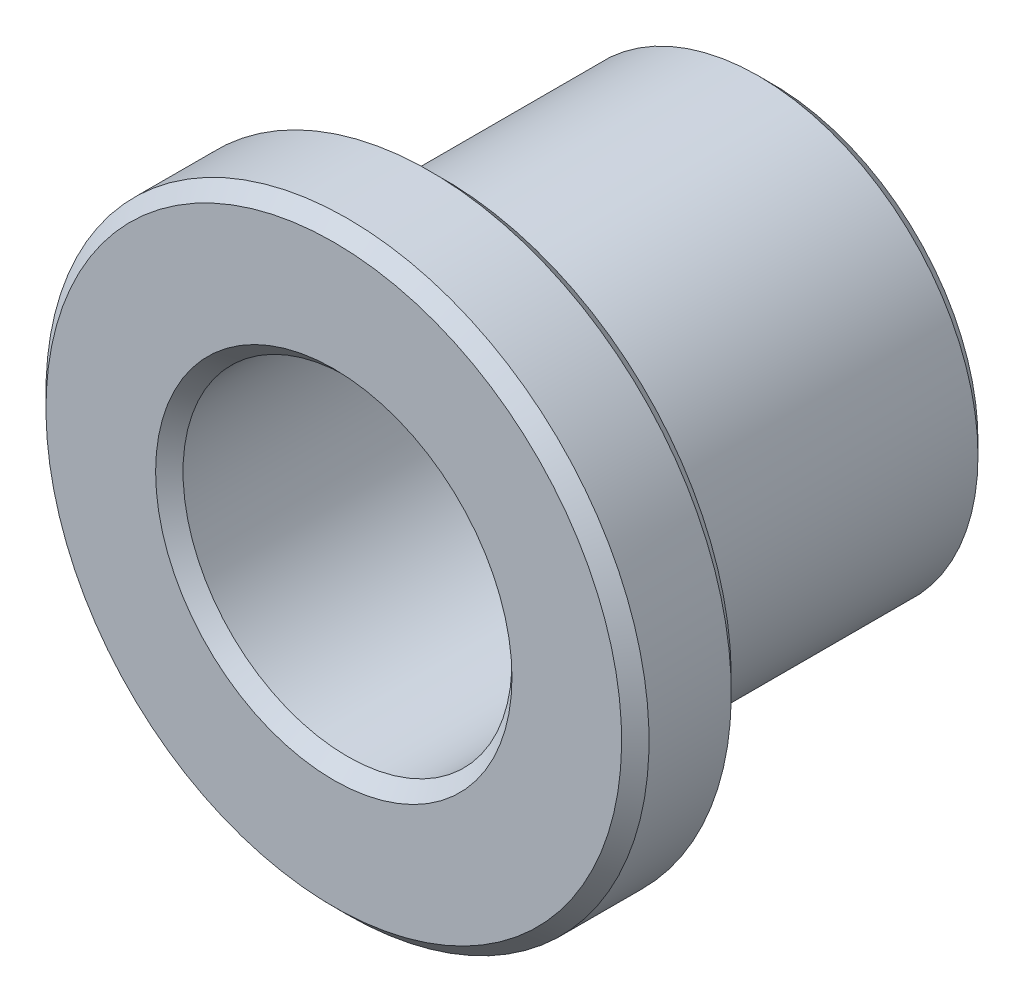
ISO-10303-21;
HEADER;
FILE_DESCRIPTION(('STEP AP214'),'2;1');
FILE_NAME('part.step','',(''),(''),'','','');
FILE_SCHEMA(('AUTOMOTIVE_DESIGN { 1 0 10303 214 1 1 1 1 }'));
ENDSEC;
DATA;
#1=APPLICATION_CONTEXT('core data for automotive mechanical design processes');
#2=APPLICATION_PROTOCOL_DEFINITION('international standard','automotive_design',2000,#1);
#3=PRODUCT_CONTEXT('',#1,'mechanical');
#4=PRODUCT('Part','Part','',(#3));
#5=PRODUCT_RELATED_PRODUCT_CATEGORY('part','',(#4));
#6=PRODUCT_DEFINITION_FORMATION('','',#4);
#7=PRODUCT_DEFINITION_CONTEXT('part definition',#1,'design');
#8=PRODUCT_DEFINITION('design','',#6,#7);
#9=PRODUCT_DEFINITION_SHAPE('','',#8);
#10=(LENGTH_UNIT() NAMED_UNIT(*) SI_UNIT(.MILLI.,.METRE.));
#11=(NAMED_UNIT(*) PLANE_ANGLE_UNIT() SI_UNIT($,.RADIAN.));
#12=(NAMED_UNIT(*) SI_UNIT($,.STERADIAN.) SOLID_ANGLE_UNIT());
#13=UNCERTAINTY_MEASURE_WITH_UNIT(LENGTH_MEASURE(1.E-05),#10,'distance_accuracy_value','');
#14=(GEOMETRIC_REPRESENTATION_CONTEXT(3) GLOBAL_UNCERTAINTY_ASSIGNED_CONTEXT((#13)) GLOBAL_UNIT_ASSIGNED_CONTEXT((#10,
#11,#12)) REPRESENTATION_CONTEXT('',''));
#15=CARTESIAN_POINT('',(0.,0.,0.));
#16=DIRECTION('',(0.,0.,1.));
#17=DIRECTION('',(1.,0.,0.));
#18=AXIS2_PLACEMENT_3D('',#15,#16,#17);
#19=CARTESIAN_POINT('',(0.,0.,0.));
#20=DIRECTION('',(0.,0.,1.));
#21=DIRECTION('',(0.,-1.,0.));
#22=AXIS2_PLACEMENT_3D('',#19,#20,#21);
#23=CYLINDRICAL_SURFACE('',#22,3.);
#24=CARTESIAN_POINT('',(0.,0.,-7.75));
#25=DIRECTION('',(0.,0.,1.));
#26=DIRECTION('',(0.,-1.,0.));
#27=AXIS2_PLACEMENT_3D('',#24,#25,#26);
#28=CIRCLE('',#27,3.);
#29=CARTESIAN_POINT('',(0.,-3.,-7.75));
#30=VERTEX_POINT('',#29);
#31=EDGE_CURVE('E61',#30,#30,#28,.F.);
#32=ORIENTED_EDGE('',*,*,#31,.T.);
#33=EDGE_LOOP('',(#32));
#34=FACE_BOUND('',#33,.T.);
#35=CARTESIAN_POINT('',(0.,0.,-0.250000000000002));
#36=DIRECTION('',(0.,0.,-1.));
#37=DIRECTION('',(0.,1.,0.));
#38=AXIS2_PLACEMENT_3D('',#35,#36,#37);
#39=CIRCLE('',#38,3.);
#40=CARTESIAN_POINT('',(0.,3.,-0.250000000000002));
#41=VERTEX_POINT('',#40);
#42=EDGE_CURVE('E64',#41,#41,#39,.F.);
#43=ORIENTED_EDGE('',*,*,#42,.T.);
#44=EDGE_LOOP('',(#43));
#45=FACE_BOUND('',#44,.T.);
#46=ADVANCED_FACE('F34',(#34,#45),#23,.F.);
#47=CARTESIAN_POINT('',(0.,3.,0.));
#48=DIRECTION('',(0.,0.,-1.));
#49=DIRECTION('',(0.,1.,0.));
#50=AXIS2_PLACEMENT_3D('',#47,#48,#49);
#51=PLANE('',#50);
#52=CARTESIAN_POINT('',(0.,0.,0.));
#53=DIRECTION('',(0.,0.,-1.));
#54=DIRECTION('',(0.,1.,0.));
#55=AXIS2_PLACEMENT_3D('',#52,#53,#54);
#56=CIRCLE('',#55,3.25);
#57=CARTESIAN_POINT('',(0.,3.25,0.));
#58=VERTEX_POINT('',#57);
#59=EDGE_CURVE('E50',#58,#58,#56,.T.);
#60=ORIENTED_EDGE('',*,*,#59,.T.);
#61=EDGE_LOOP('',(#60));
#62=FACE_BOUND('',#61,.T.);
#63=CARTESIAN_POINT('',(0.,0.,0.));
#64=DIRECTION('',(0.,0.,-1.));
#65=DIRECTION('',(0.,1.,0.));
#66=AXIS2_PLACEMENT_3D('',#63,#64,#65);
#67=CIRCLE('',#66,5.25);
#68=CARTESIAN_POINT('',(0.,5.25,0.));
#69=VERTEX_POINT('',#68);
#70=EDGE_CURVE('E55',#69,#69,#67,.F.);
#71=ORIENTED_EDGE('',*,*,#70,.T.);
#72=EDGE_LOOP('',(#71));
#73=FACE_BOUND('',#72,.T.);
#74=ADVANCED_FACE('F94',(#62,#73),#51,.F.);
#75=CARTESIAN_POINT('',(0.,0.,0.));
#76=DIRECTION('',(0.,0.,1.));
#77=DIRECTION('',(0.,-1.,0.));
#78=AXIS2_PLACEMENT_3D('',#75,#76,#77);
#79=CYLINDRICAL_SURFACE('',#78,5.5);
#80=CARTESIAN_POINT('',(0.,0.,-1.75));
#81=DIRECTION('',(0.,0.,1.));
#82=DIRECTION('',(0.,-1.,0.));
#83=AXIS2_PLACEMENT_3D('',#80,#81,#82);
#84=CIRCLE('',#83,5.5);
#85=CARTESIAN_POINT('',(0.,-5.5,-1.75));
#86=VERTEX_POINT('',#85);
#87=EDGE_CURVE('E42',#86,#86,#84,.T.);
#88=ORIENTED_EDGE('',*,*,#87,.T.);
#89=EDGE_LOOP('',(#88));
#90=FACE_BOUND('',#89,.T.);
#91=CARTESIAN_POINT('',(0.,0.,-0.249999999999999));
#92=DIRECTION('',(0.,0.,-1.));
#93=DIRECTION('',(0.,1.,0.));
#94=AXIS2_PLACEMENT_3D('',#91,#92,#93);
#95=CIRCLE('',#94,5.5);
#96=CARTESIAN_POINT('',(0.,5.5,-0.249999999999999));
#97=VERTEX_POINT('',#96);
#98=EDGE_CURVE('E46',#97,#97,#95,.T.);
#99=ORIENTED_EDGE('',*,*,#98,.T.);
#100=EDGE_LOOP('',(#99));
#101=FACE_BOUND('',#100,.T.);
#102=ADVANCED_FACE('F91',(#90,#101),#79,.T.);
#103=CARTESIAN_POINT('',(0.,5.5,-2.));
#104=DIRECTION('',(0.,0.,1.));
#105=DIRECTION('',(0.,-1.,0.));
#106=AXIS2_PLACEMENT_3D('',#103,#104,#105);
#107=PLANE('',#106);
#108=CARTESIAN_POINT('',(0.,0.,-2.));
#109=DIRECTION('',(0.,0.,1.));
#110=DIRECTION('',(0.,-1.,0.));
#111=AXIS2_PLACEMENT_3D('',#108,#109,#110);
#112=CIRCLE('',#111,5.25);
#113=CARTESIAN_POINT('',(0.,-5.25,-2.));
#114=VERTEX_POINT('',#113);
#115=EDGE_CURVE('E10',#114,#114,#112,.F.);
#116=ORIENTED_EDGE('',*,*,#115,.T.);
#117=EDGE_LOOP('',(#116));
#118=FACE_BOUND('',#117,.T.);
#119=CARTESIAN_POINT('',(0.,0.,-2.));
#120=DIRECTION('',(0.,0.,1.));
#121=DIRECTION('',(0.,-1.,0.));
#122=AXIS2_PLACEMENT_3D('',#119,#120,#121);
#123=CIRCLE('',#122,4.);
#124=CARTESIAN_POINT('',(0.,-4.,-2.));
#125=VERTEX_POINT('',#124);
#126=EDGE_CURVE('E73',#125,#125,#123,.T.);
#127=ORIENTED_EDGE('',*,*,#126,.T.);
#128=EDGE_LOOP('',(#127));
#129=FACE_BOUND('',#128,.T.);
#130=ADVANCED_FACE('F77',(#118,#129),#107,.F.);
#131=CARTESIAN_POINT('',(0.,0.,0.));
#132=DIRECTION('',(0.,0.,1.));
#133=DIRECTION('',(0.,-1.,0.));
#134=AXIS2_PLACEMENT_3D('',#131,#132,#133);
#135=CYLINDRICAL_SURFACE('',#134,4.);
#136=CARTESIAN_POINT('',(0.,0.,-7.74999999999999));
#137=DIRECTION('',(0.,0.,1.));
#138=DIRECTION('',(0.,-1.,0.));
#139=AXIS2_PLACEMENT_3D('',#136,#137,#138);
#140=CIRCLE('',#139,4.);
#141=CARTESIAN_POINT('',(0.,-4.,-7.74999999999999));
#142=VERTEX_POINT('',#141);
#143=EDGE_CURVE('E58',#142,#142,#140,.T.);
#144=ORIENTED_EDGE('',*,*,#143,.T.);
#145=EDGE_LOOP('',(#144));
#146=FACE_BOUND('',#145,.T.);
#147=ORIENTED_EDGE('',*,*,#126,.F.);
#148=EDGE_LOOP('',(#147));
#149=FACE_BOUND('',#148,.T.);
#150=ADVANCED_FACE('F79',(#146,#149),#135,.T.);
#151=CARTESIAN_POINT('',(0.,4.,-8.));
#152=DIRECTION('',(0.,0.,1.));
#153=DIRECTION('',(0.,-1.,0.));
#154=AXIS2_PLACEMENT_3D('',#151,#152,#153);
#155=PLANE('',#154);
#156=CARTESIAN_POINT('',(0.,0.,-8.));
#157=DIRECTION('',(0.,0.,1.));
#158=DIRECTION('',(0.,-1.,0.));
#159=AXIS2_PLACEMENT_3D('',#156,#157,#158);
#160=CIRCLE('',#159,3.25);
#161=CARTESIAN_POINT('',(0.,-3.25,-8.));
#162=VERTEX_POINT('',#161);
#163=EDGE_CURVE('E67',#162,#162,#160,.T.);
#164=ORIENTED_EDGE('',*,*,#163,.T.);
#165=EDGE_LOOP('',(#164));
#166=FACE_BOUND('',#165,.T.);
#167=CARTESIAN_POINT('',(0.,0.,-8.));
#168=DIRECTION('',(0.,0.,1.));
#169=DIRECTION('',(0.,-1.,0.));
#170=AXIS2_PLACEMENT_3D('',#167,#168,#169);
#171=CIRCLE('',#170,3.74999999999999);
#172=CARTESIAN_POINT('',(0.,-3.74999999999999,-8.));
#173=VERTEX_POINT('',#172);
#174=EDGE_CURVE('E70',#173,#173,#171,.F.);
#175=ORIENTED_EDGE('',*,*,#174,.T.);
#176=EDGE_LOOP('',(#175));
#177=FACE_BOUND('',#176,.T.);
#178=ADVANCED_FACE('F81',(#166,#177),#155,.F.);
#179=CARTESIAN_POINT('',(0.,0.,-8.));
#180=DIRECTION('',(0.,0.,-1.));
#181=DIRECTION('',(0.,1.,0.));
#182=AXIS2_PLACEMENT_3D('',#179,#180,#181);
#183=CONICAL_SURFACE('',#182,3.25,0.785398163397448);
#184=ORIENTED_EDGE('',*,*,#31,.F.);
#185=EDGE_LOOP('',(#184));
#186=FACE_BOUND('',#185,.T.);
#187=ORIENTED_EDGE('',*,*,#163,.F.);
#188=EDGE_LOOP('',(#187));
#189=FACE_BOUND('',#188,.T.);
#190=ADVANCED_FACE('F88',(#186,#189),#183,.F.);
#191=CARTESIAN_POINT('',(0.,0.,-7.74999999999999));
#192=DIRECTION('',(0.,0.,1.));
#193=DIRECTION('',(0.,-1.,0.));
#194=AXIS2_PLACEMENT_3D('',#191,#192,#193);
#195=CONICAL_SURFACE('',#194,4.,0.785398163397452);
#196=ORIENTED_EDGE('',*,*,#174,.F.);
#197=EDGE_LOOP('',(#196));
#198=FACE_BOUND('',#197,.T.);
#199=ORIENTED_EDGE('',*,*,#143,.F.);
#200=EDGE_LOOP('',(#199));
#201=FACE_BOUND('',#200,.T.);
#202=ADVANCED_FACE('F111',(#198,#201),#195,.T.);
#203=CARTESIAN_POINT('',(0.,0.,-0.250000000000002));
#204=DIRECTION('',(0.,0.,1.));
#205=DIRECTION('',(0.,-1.,0.));
#206=AXIS2_PLACEMENT_3D('',#203,#204,#205);
#207=CONICAL_SURFACE('',#206,3.,0.785398163397448);
#208=ORIENTED_EDGE('',*,*,#59,.F.);
#209=EDGE_LOOP('',(#208));
#210=FACE_BOUND('',#209,.T.);
#211=ORIENTED_EDGE('',*,*,#42,.F.);
#212=EDGE_LOOP('',(#211));
#213=FACE_BOUND('',#212,.T.);
#214=ADVANCED_FACE('F118',(#210,#213),#207,.F.);
#215=CARTESIAN_POINT('',(0.,0.,-1.75));
#216=DIRECTION('',(0.,0.,1.));
#217=DIRECTION('',(0.,-1.,0.));
#218=AXIS2_PLACEMENT_3D('',#215,#216,#217);
#219=CONICAL_SURFACE('',#218,5.5,0.785398163397452);
#220=ORIENTED_EDGE('',*,*,#115,.F.);
#221=EDGE_LOOP('',(#220));
#222=FACE_BOUND('',#221,.T.);
#223=ORIENTED_EDGE('',*,*,#87,.F.);
#224=EDGE_LOOP('',(#223));
#225=FACE_BOUND('',#224,.T.);
#226=ADVANCED_FACE('F124',(#222,#225),#219,.T.);
#227=CARTESIAN_POINT('',(0.,0.,0.));
#228=DIRECTION('',(0.,0.,-1.));
#229=DIRECTION('',(0.,1.,0.));
#230=AXIS2_PLACEMENT_3D('',#227,#228,#229);
#231=CONICAL_SURFACE('',#230,5.25,0.785398163397448);
#232=ORIENTED_EDGE('',*,*,#98,.F.);
#233=EDGE_LOOP('',(#232));
#234=FACE_BOUND('',#233,.T.);
#235=ORIENTED_EDGE('',*,*,#70,.F.);
#236=EDGE_LOOP('',(#235));
#237=FACE_BOUND('',#236,.T.);
#238=ADVANCED_FACE('F37',(#234,#237),#231,.T.);
#239=CLOSED_SHELL('',(#46,#74,#102,#130,#150,#178,#190,#202,#214,#226,#238));
#240=MANIFOLD_SOLID_BREP('B2',#239);
#241=ADVANCED_BREP_SHAPE_REPRESENTATION('',(#18,#240),#14);
#242=SHAPE_DEFINITION_REPRESENTATION(#9,#241);
ENDSEC;
END-ISO-10303-21;
